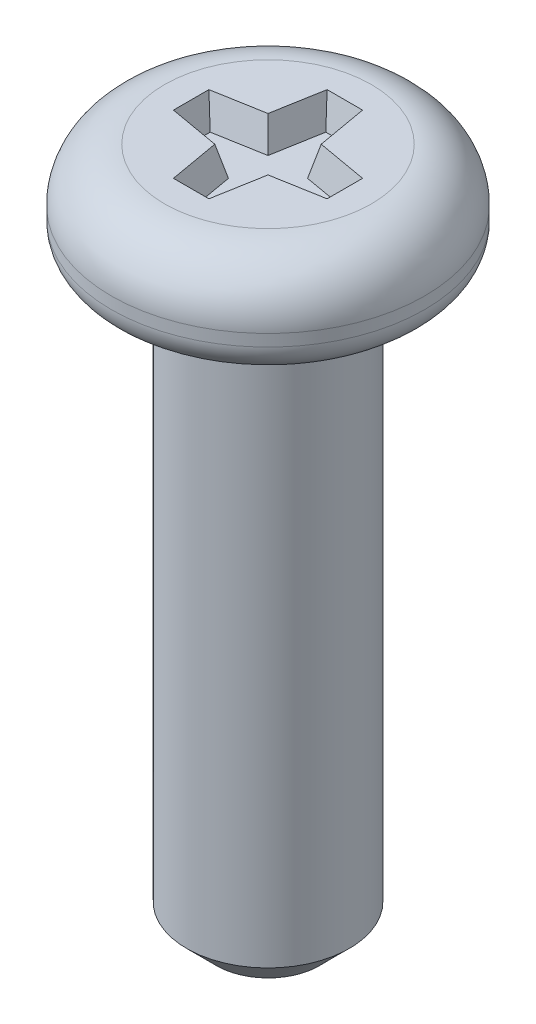
ISO-10303-21;
HEADER;
FILE_DESCRIPTION(('STEP AP214'),'2;1');
FILE_NAME('part.step','',(''),(''),'','','');
FILE_SCHEMA(('AUTOMOTIVE_DESIGN { 1 0 10303 214 1 1 1 1 }'));
ENDSEC;
DATA;
#1=APPLICATION_CONTEXT('core data for automotive mechanical design processes');
#2=APPLICATION_PROTOCOL_DEFINITION('international standard','automotive_design',2000,#1);
#3=PRODUCT_CONTEXT('',#1,'mechanical');
#4=PRODUCT('Part','Part','',(#3));
#5=PRODUCT_RELATED_PRODUCT_CATEGORY('part','',(#4));
#6=PRODUCT_DEFINITION_FORMATION('','',#4);
#7=PRODUCT_DEFINITION_CONTEXT('part definition',#1,'design');
#8=PRODUCT_DEFINITION('design','',#6,#7);
#9=PRODUCT_DEFINITION_SHAPE('','',#8);
#10=(LENGTH_UNIT() NAMED_UNIT(*) SI_UNIT(.MILLI.,.METRE.));
#11=(NAMED_UNIT(*) PLANE_ANGLE_UNIT() SI_UNIT($,.RADIAN.));
#12=(NAMED_UNIT(*) SI_UNIT($,.STERADIAN.) SOLID_ANGLE_UNIT());
#13=UNCERTAINTY_MEASURE_WITH_UNIT(LENGTH_MEASURE(1.E-05),#10,'distance_accuracy_value','');
#14=(GEOMETRIC_REPRESENTATION_CONTEXT(3) GLOBAL_UNCERTAINTY_ASSIGNED_CONTEXT((#13)) GLOBAL_UNIT_ASSIGNED_CONTEXT((#10,
#11,#12)) REPRESENTATION_CONTEXT('',''));
#15=CARTESIAN_POINT('',(0.,0.,0.));
#16=DIRECTION('',(0.,0.,1.));
#17=DIRECTION('',(1.,0.,0.));
#18=AXIS2_PLACEMENT_3D('',#15,#16,#17);
#19=CARTESIAN_POINT('',(1.75,0.,0.));
#20=DIRECTION('',(0.,-1.,0.));
#21=DIRECTION('',(1.,0.,0.));
#22=AXIS2_PLACEMENT_3D('',#19,#20,#21);
#23=PLANE('',#22);
#24=DIRECTION('',(-1.,0.,0.));
#25=VECTOR('',#24,1.);
#26=CARTESIAN_POINT('',(-0.300122066397808,0.,-1.3));
#27=LINE('',#26,#25);
#28=CARTESIAN_POINT('',(0.300122066397808,0.,-1.3));
#29=VERTEX_POINT('',#28);
#30=CARTESIAN_POINT('',(-0.300122066397808,0.,-1.3));
#31=VERTEX_POINT('',#30);
#32=EDGE_CURVE('E139',#29,#31,#27,.T.);
#33=ORIENTED_EDGE('',*,*,#32,.F.);
#34=DIRECTION('',(-0.173648177666927,0.,-0.984807753012208));
#35=VECTOR('',#34,1.);
#36=CARTESIAN_POINT('',(0.300122066397808,0.,-1.3));
#37=LINE('',#36,#35);
#38=CARTESIAN_POINT('',(0.45,0.,-0.45));
#39=VERTEX_POINT('',#38);
#40=EDGE_CURVE('E47',#39,#29,#37,.T.);
#41=ORIENTED_EDGE('',*,*,#40,.F.);
#42=DIRECTION('',(-0.984807753012208,0.,-0.173648177666927));
#43=VECTOR('',#42,1.);
#44=CARTESIAN_POINT('',(0.45,0.,-0.45));
#45=LINE('',#44,#43);
#46=CARTESIAN_POINT('',(1.3,0.,-0.300122066397808));
#47=VERTEX_POINT('',#46);
#48=EDGE_CURVE('E171',#47,#39,#45,.T.);
#49=ORIENTED_EDGE('',*,*,#48,.F.);
#50=DIRECTION('',(0.,0.,-1.));
#51=VECTOR('',#50,1.);
#52=CARTESIAN_POINT('',(1.3,0.,-0.300122066397808));
#53=LINE('',#52,#51);
#54=CARTESIAN_POINT('',(1.3,0.,0.300122066397808));
#55=VERTEX_POINT('',#54);
#56=EDGE_CURVE('E169',#55,#47,#53,.T.);
#57=ORIENTED_EDGE('',*,*,#56,.F.);
#58=DIRECTION('',(0.984807753012208,0.,-0.173648177666927));
#59=VECTOR('',#58,1.);
#60=CARTESIAN_POINT('',(0.45,0.,0.45));
#61=LINE('',#60,#59);
#62=CARTESIAN_POINT('',(0.45,0.,0.45));
#63=VERTEX_POINT('',#62);
#64=EDGE_CURVE('E166',#63,#55,#61,.T.);
#65=ORIENTED_EDGE('',*,*,#64,.F.);
#66=DIRECTION('',(0.173648177666927,0.,-0.984807753012208));
#67=VECTOR('',#66,1.);
#68=CARTESIAN_POINT('',(0.300122066397808,0.,1.3));
#69=LINE('',#68,#67);
#70=CARTESIAN_POINT('',(0.300122066397808,0.,1.3));
#71=VERTEX_POINT('',#70);
#72=EDGE_CURVE('E163',#71,#63,#69,.T.);
#73=ORIENTED_EDGE('',*,*,#72,.F.);
#74=DIRECTION('',(1.,0.,0.));
#75=VECTOR('',#74,1.);
#76=CARTESIAN_POINT('',(-0.300122066397808,0.,1.3));
#77=LINE('',#76,#75);
#78=CARTESIAN_POINT('',(-0.300122066397808,0.,1.3));
#79=VERTEX_POINT('',#78);
#80=EDGE_CURVE('E160',#79,#71,#77,.T.);
#81=ORIENTED_EDGE('',*,*,#80,.F.);
#82=DIRECTION('',(0.173648177666927,0.,0.984807753012208));
#83=VECTOR('',#82,1.);
#84=CARTESIAN_POINT('',(-0.300122066397808,0.,1.3));
#85=LINE('',#84,#83);
#86=CARTESIAN_POINT('',(-0.45,0.,0.45));
#87=VERTEX_POINT('',#86);
#88=EDGE_CURVE('E157',#87,#79,#85,.T.);
#89=ORIENTED_EDGE('',*,*,#88,.F.);
#90=DIRECTION('',(0.984807753012208,0.,0.173648177666927));
#91=VECTOR('',#90,1.);
#92=CARTESIAN_POINT('',(-0.45,0.,0.45));
#93=LINE('',#92,#91);
#94=CARTESIAN_POINT('',(-1.3,0.,0.300122066397808));
#95=VERTEX_POINT('',#94);
#96=EDGE_CURVE('E154',#95,#87,#93,.T.);
#97=ORIENTED_EDGE('',*,*,#96,.F.);
#98=DIRECTION('',(0.,0.,1.));
#99=VECTOR('',#98,1.);
#100=CARTESIAN_POINT('',(-1.3,0.,-0.300122066397808));
#101=LINE('',#100,#99);
#102=CARTESIAN_POINT('',(-1.3,0.,-0.300122066397808));
#103=VERTEX_POINT('',#102);
#104=EDGE_CURVE('E148',#103,#95,#101,.T.);
#105=ORIENTED_EDGE('',*,*,#104,.F.);
#106=DIRECTION('',(-0.984807753012208,0.,0.173648177666927));
#107=VECTOR('',#106,1.);
#108=CARTESIAN_POINT('',(-0.45,0.,-0.45));
#109=LINE('',#108,#107);
#110=CARTESIAN_POINT('',(-0.45,0.,-0.45));
#111=VERTEX_POINT('',#110);
#112=EDGE_CURVE('E146',#111,#103,#109,.T.);
#113=ORIENTED_EDGE('',*,*,#112,.F.);
#114=DIRECTION('',(-0.173648177666927,0.,0.984807753012208));
#115=VECTOR('',#114,1.);
#116=CARTESIAN_POINT('',(-0.300122066397808,0.,-1.3));
#117=LINE('',#116,#115);
#118=EDGE_CURVE('E130',#31,#111,#117,.T.);
#119=ORIENTED_EDGE('',*,*,#118,.F.);
#120=EDGE_LOOP('',(#33,#41,#49,#57,#65,#73,#81,#89,#97,#105,#113,#119));
#121=FACE_BOUND('',#120,.T.);
#122=CARTESIAN_POINT('',(0.,0.,0.));
#123=DIRECTION('',(0.,1.,0.));
#124=DIRECTION('',(-1.,0.,0.));
#125=AXIS2_PLACEMENT_3D('',#122,#123,#124);
#126=CIRCLE('',#125,1.75);
#127=CARTESIAN_POINT('',(-1.75,0.,0.));
#128=VERTEX_POINT('',#127);
#129=EDGE_CURVE('E11',#128,#128,#126,.T.);
#130=ORIENTED_EDGE('',*,*,#129,.T.);
#131=EDGE_LOOP('',(#130));
#132=FACE_BOUND('',#131,.T.);
#133=ADVANCED_FACE('F33',(#121,#132),#23,.F.);
#134=CARTESIAN_POINT('',(0.,-0.9,0.));
#135=DIRECTION('',(0.,1.,0.));
#136=DIRECTION('',(-1.,0.,0.));
#137=AXIS2_PLACEMENT_3D('',#134,#135,#136);
#138=TOROIDAL_SURFACE('',#137,1.75,0.9);
#139=ORIENTED_EDGE('',*,*,#129,.F.);
#140=EDGE_LOOP('',(#139));
#141=FACE_BOUND('',#140,.T.);
#142=CARTESIAN_POINT('',(0.,-0.9,0.));
#143=DIRECTION('',(0.,1.,0.));
#144=DIRECTION('',(-1.,0.,0.));
#145=AXIS2_PLACEMENT_3D('',#142,#143,#144);
#146=CIRCLE('',#145,2.65);
#147=CARTESIAN_POINT('',(-2.65,-0.900000000000001,0.));
#148=VERTEX_POINT('',#147);
#149=EDGE_CURVE('E40',#148,#148,#146,.T.);
#150=ORIENTED_EDGE('',*,*,#149,.T.);
#151=EDGE_LOOP('',(#150));
#152=FACE_BOUND('',#151,.T.);
#153=ADVANCED_FACE('F244',(#141,#152),#138,.T.);
#154=CARTESIAN_POINT('',(0.,0.,0.));
#155=DIRECTION('',(0.,1.,0.));
#156=DIRECTION('',(-1.,0.,0.));
#157=AXIS2_PLACEMENT_3D('',#154,#155,#156);
#158=CYLINDRICAL_SURFACE('',#157,2.65);
#159=ORIENTED_EDGE('',*,*,#149,.F.);
#160=EDGE_LOOP('',(#159));
#161=FACE_BOUND('',#160,.T.);
#162=CARTESIAN_POINT('',(0.,-1.1,0.));
#163=DIRECTION('',(0.,1.,0.));
#164=DIRECTION('',(-1.,0.,0.));
#165=AXIS2_PLACEMENT_3D('',#162,#163,#164);
#166=CIRCLE('',#165,2.65);
#167=CARTESIAN_POINT('',(-2.65,-1.1,0.));
#168=VERTEX_POINT('',#167);
#169=EDGE_CURVE('E239',#168,#168,#166,.T.);
#170=ORIENTED_EDGE('',*,*,#169,.T.);
#171=EDGE_LOOP('',(#170));
#172=FACE_BOUND('',#171,.T.);
#173=ADVANCED_FACE('F246',(#161,#172),#158,.T.);
#174=CARTESIAN_POINT('',(0.,-1.1,0.));
#175=DIRECTION('',(0.,1.,0.));
#176=DIRECTION('',(-1.,0.,0.));
#177=AXIS2_PLACEMENT_3D('',#174,#175,#176);
#178=TOROIDAL_SURFACE('',#177,2.15,0.5);
#179=ORIENTED_EDGE('',*,*,#169,.F.);
#180=EDGE_LOOP('',(#179));
#181=FACE_BOUND('',#180,.T.);
#182=CARTESIAN_POINT('',(0.,-1.6,0.));
#183=DIRECTION('',(0.,1.,0.));
#184=DIRECTION('',(-1.,0.,0.));
#185=AXIS2_PLACEMENT_3D('',#182,#183,#184);
#186=CIRCLE('',#185,2.15);
#187=CARTESIAN_POINT('',(-2.15,-1.6,0.));
#188=VERTEX_POINT('',#187);
#189=EDGE_CURVE('E236',#188,#188,#186,.T.);
#190=ORIENTED_EDGE('',*,*,#189,.T.);
#191=EDGE_LOOP('',(#190));
#192=FACE_BOUND('',#191,.T.);
#193=ADVANCED_FACE('F249',(#181,#192),#178,.T.);
#194=CARTESIAN_POINT('',(1.525,-1.6,0.));
#195=DIRECTION('',(0.,1.,0.));
#196=DIRECTION('',(-1.,0.,0.));
#197=AXIS2_PLACEMENT_3D('',#194,#195,#196);
#198=PLANE('',#197);
#199=ORIENTED_EDGE('',*,*,#189,.F.);
#200=EDGE_LOOP('',(#199));
#201=FACE_BOUND('',#200,.T.);
#202=CARTESIAN_POINT('',(0.,-1.6,0.));
#203=DIRECTION('',(0.,1.,0.));
#204=DIRECTION('',(-1.,0.,0.));
#205=AXIS2_PLACEMENT_3D('',#202,#203,#204);
#206=CIRCLE('',#205,1.525);
#207=CARTESIAN_POINT('',(-1.525,-1.6,0.));
#208=VERTEX_POINT('',#207);
#209=EDGE_CURVE('E233',#208,#208,#206,.T.);
#210=ORIENTED_EDGE('',*,*,#209,.T.);
#211=EDGE_LOOP('',(#210));
#212=FACE_BOUND('',#211,.T.);
#213=ADVANCED_FACE('F255',(#201,#212),#198,.F.);
#214=CARTESIAN_POINT('',(0.,-1.75,0.));
#215=DIRECTION('',(0.,1.,0.));
#216=DIRECTION('',(-1.,0.,0.));
#217=AXIS2_PLACEMENT_3D('',#214,#215,#216);
#218=TOROIDAL_SURFACE('',#217,1.525,0.15);
#219=ORIENTED_EDGE('',*,*,#209,.F.);
#220=EDGE_LOOP('',(#219));
#221=FACE_BOUND('',#220,.T.);
#222=CARTESIAN_POINT('',(0.,-1.75,0.));
#223=DIRECTION('',(0.,1.,0.));
#224=DIRECTION('',(-1.,0.,0.));
#225=AXIS2_PLACEMENT_3D('',#222,#223,#224);
#226=CIRCLE('',#225,1.375);
#227=CARTESIAN_POINT('',(-1.375,-1.75,0.));
#228=VERTEX_POINT('',#227);
#229=EDGE_CURVE('E230',#228,#228,#226,.T.);
#230=ORIENTED_EDGE('',*,*,#229,.T.);
#231=EDGE_LOOP('',(#230));
#232=FACE_BOUND('',#231,.T.);
#233=ADVANCED_FACE('F261',(#221,#232),#218,.F.);
#234=CARTESIAN_POINT('',(0.,0.,0.));
#235=DIRECTION('',(0.,1.,0.));
#236=DIRECTION('',(-1.,0.,0.));
#237=AXIS2_PLACEMENT_3D('',#234,#235,#236);
#238=CYLINDRICAL_SURFACE('',#237,1.375);
#239=ORIENTED_EDGE('',*,*,#229,.F.);
#240=EDGE_LOOP('',(#239));
#241=FACE_BOUND('',#240,.T.);
#242=CARTESIAN_POINT('',(0.,-11.1,0.));
#243=DIRECTION('',(0.,1.,0.));
#244=DIRECTION('',(-1.,0.,0.));
#245=AXIS2_PLACEMENT_3D('',#242,#243,#244);
#246=CIRCLE('',#245,1.375);
#247=CARTESIAN_POINT('',(-1.375,-11.1,0.));
#248=VERTEX_POINT('',#247);
#249=EDGE_CURVE('E227',#248,#248,#246,.T.);
#250=ORIENTED_EDGE('',*,*,#249,.T.);
#251=EDGE_LOOP('',(#250));
#252=FACE_BOUND('',#251,.T.);
#253=ADVANCED_FACE('F267',(#241,#252),#238,.T.);
#254=CARTESIAN_POINT('',(0.,-11.6,0.));
#255=DIRECTION('',(0.,1.,0.));
#256=DIRECTION('',(-1.,0.,0.));
#257=AXIS2_PLACEMENT_3D('',#254,#255,#256);
#258=CONICAL_SURFACE('',#257,0.875000000000006,0.78539816339744);
#259=ORIENTED_EDGE('',*,*,#249,.F.);
#260=EDGE_LOOP('',(#259));
#261=FACE_BOUND('',#260,.T.);
#262=CARTESIAN_POINT('',(0.,-11.6,0.));
#263=DIRECTION('',(0.,1.,0.));
#264=DIRECTION('',(-1.,0.,0.));
#265=AXIS2_PLACEMENT_3D('',#262,#263,#264);
#266=CIRCLE('',#265,0.875000000000006);
#267=CARTESIAN_POINT('',(-0.875000000000004,-11.6,0.));
#268=VERTEX_POINT('',#267);
#269=EDGE_CURVE('E175',#268,#268,#266,.T.);
#270=ORIENTED_EDGE('',*,*,#269,.T.);
#271=EDGE_LOOP('',(#270));
#272=FACE_BOUND('',#271,.T.);
#273=ADVANCED_FACE('F273',(#261,#272),#258,.T.);
#274=CARTESIAN_POINT('',(0.,-11.6,0.));
#275=DIRECTION('',(0.,1.,0.));
#276=DIRECTION('',(-1.,0.,0.));
#277=AXIS2_PLACEMENT_3D('',#274,#275,#276);
#278=PLANE('',#277);
#279=ORIENTED_EDGE('',*,*,#269,.F.);
#280=EDGE_LOOP('',(#279));
#281=FACE_BOUND('',#280,.T.);
#282=ADVANCED_FACE('F279',(#281),#278,.F.);
#283=CARTESIAN_POINT('',(0.300122066397808,0.,-1.3));
#284=DIRECTION('',(0.951251242564198,-0.258819045102521,-0.167731259496517));
#285=DIRECTION('',(0.262538491736643,0.964921520309631,0.));
#286=AXIS2_PLACEMENT_3D('',#283,#284,#285);
#287=PLANE('',#286);
#288=ORIENTED_EDGE('',*,*,#40,.T.);
#289=DIRECTION('',(0.212227769095221,0.943922256203466,-0.252923206267483));
#290=VECTOR('',#289,1.);
#291=CARTESIAN_POINT('',(0.300122066397808,0.,-1.3));
#292=LINE('',#291,#290);
#293=CARTESIAN_POINT('',(0.187704032126204,-0.5,-1.16602540378444));
#294=VERTEX_POINT('',#293);
#295=EDGE_CURVE('E90',#294,#29,#292,.T.);
#296=ORIENTED_EDGE('',*,*,#295,.F.);
#297=DIRECTION('',(-0.173648177666927,0.,-0.984807753012209));
#298=VECTOR('',#297,1.);
#299=CARTESIAN_POINT('',(0.381446150865339,-0.5,-0.0672592480849495));
#300=LINE('',#299,#298);
#301=CARTESIAN_POINT('',(0.33435071834194,-0.5,-0.33435071834194));
#302=VERTEX_POINT('',#301);
#303=EDGE_CURVE('E173',#302,#294,#300,.T.);
#304=ORIENTED_EDGE('',*,*,#303,.F.);
#305=DIRECTION('',(0.219836351209983,0.950444084296053,-0.219836351209983));
#306=VECTOR('',#305,1.);
#307=CARTESIAN_POINT('',(0.483835514146798,0.146285016481293,-0.483835514146798));
#308=LINE('',#307,#306);
#309=EDGE_CURVE('E55',#302,#39,#308,.T.);
#310=ORIENTED_EDGE('',*,*,#309,.T.);
#311=EDGE_LOOP('',(#288,#296,#304,#310));
#312=FACE_BOUND('',#311,.T.);
#313=ADVANCED_FACE('F284',(#312),#287,.F.);
#314=CARTESIAN_POINT('',(0.45,0.,-0.45));
#315=DIRECTION('',(0.167731259496517,-0.258819045102521,-0.951251242564198));
#316=DIRECTION('',(0.,0.964921520309631,-0.262538491736643));
#317=AXIS2_PLACEMENT_3D('',#314,#315,#316);
#318=PLANE('',#317);
#319=ORIENTED_EDGE('',*,*,#48,.T.);
#320=ORIENTED_EDGE('',*,*,#309,.F.);
#321=DIRECTION('',(-0.984807753012209,0.,-0.173648177666927));
#322=VECTOR('',#321,1.);
#323=CARTESIAN_POINT('',(0.0672592480849496,-0.5,-0.381446150865339));
#324=LINE('',#323,#322);
#325=CARTESIAN_POINT('',(1.16602540378444,-0.5,-0.187704032126204));
#326=VERTEX_POINT('',#325);
#327=EDGE_CURVE('E176',#326,#302,#324,.T.);
#328=ORIENTED_EDGE('',*,*,#327,.F.);
#329=DIRECTION('',(0.252923206267483,0.943922256203466,-0.212227769095221));
#330=VECTOR('',#329,1.);
#331=CARTESIAN_POINT('',(1.3,0.,-0.300122066397808));
#332=LINE('',#331,#330);
#333=EDGE_CURVE('E95',#326,#47,#332,.T.);
#334=ORIENTED_EDGE('',*,*,#333,.T.);
#335=EDGE_LOOP('',(#319,#320,#328,#334));
#336=FACE_BOUND('',#335,.T.);
#337=ADVANCED_FACE('F289',(#336),#318,.F.);
#338=CARTESIAN_POINT('',(1.3,0.,-0.300122066397808));
#339=DIRECTION('',(0.965925826289068,-0.258819045102521,0.));
#340=DIRECTION('',(0.258819045102521,0.965925826289068,0.));
#341=AXIS2_PLACEMENT_3D('',#338,#339,#340);
#342=PLANE('',#341);
#343=ORIENTED_EDGE('',*,*,#56,.T.);
#344=ORIENTED_EDGE('',*,*,#333,.F.);
#345=DIRECTION('',(0.,0.,-1.));
#346=VECTOR('',#345,1.);
#347=CARTESIAN_POINT('',(1.16602540378444,-0.5,0.));
#348=LINE('',#347,#346);
#349=CARTESIAN_POINT('',(1.16602540378444,-0.5,0.187704032126204));
#350=VERTEX_POINT('',#349);
#351=EDGE_CURVE('E199',#350,#326,#348,.T.);
#352=ORIENTED_EDGE('',*,*,#351,.F.);
#353=DIRECTION('',(0.252923206267483,0.943922256203466,0.212227769095221));
#354=VECTOR('',#353,1.);
#355=CARTESIAN_POINT('',(1.2536704209464,-0.172904342921303,0.261246933701336));
#356=LINE('',#355,#354);
#357=EDGE_CURVE('E191',#350,#55,#356,.T.);
#358=ORIENTED_EDGE('',*,*,#357,.T.);
#359=EDGE_LOOP('',(#343,#344,#352,#358));
#360=FACE_BOUND('',#359,.T.);
#361=ADVANCED_FACE('F347',(#360),#342,.F.);
#362=CARTESIAN_POINT('',(0.45,0.,0.45));
#363=DIRECTION('',(0.167731259496517,-0.258819045102521,0.951251242564198));
#364=DIRECTION('',(0.,-0.964921520309631,-0.262538491736643));
#365=AXIS2_PLACEMENT_3D('',#362,#363,#364);
#366=PLANE('',#365);
#367=ORIENTED_EDGE('',*,*,#64,.T.);
#368=ORIENTED_EDGE('',*,*,#357,.F.);
#369=DIRECTION('',(0.984807753012209,0.,-0.173648177666927));
#370=VECTOR('',#369,1.);
#371=CARTESIAN_POINT('',(0.0672592480849496,-0.5,0.381446150865339));
#372=LINE('',#371,#370);
#373=CARTESIAN_POINT('',(0.33435071834194,-0.5,0.33435071834194));
#374=VERTEX_POINT('',#373);
#375=EDGE_CURVE('E202',#374,#350,#372,.T.);
#376=ORIENTED_EDGE('',*,*,#375,.F.);
#377=DIRECTION('',(0.219836351209983,0.950444084296053,0.219836351209983));
#378=VECTOR('',#377,1.);
#379=CARTESIAN_POINT('',(0.45,0.,0.45));
#380=LINE('',#379,#378);
#381=EDGE_CURVE('E189',#374,#63,#380,.T.);
#382=ORIENTED_EDGE('',*,*,#381,.T.);
#383=EDGE_LOOP('',(#367,#368,#376,#382));
#384=FACE_BOUND('',#383,.T.);
#385=ADVANCED_FACE('F355',(#384),#366,.F.);
#386=CARTESIAN_POINT('',(0.300122066397808,0.,1.3));
#387=DIRECTION('',(0.951251242564198,-0.258819045102521,0.167731259496517));
#388=DIRECTION('',(0.262538491736643,0.964921520309631,0.));
#389=AXIS2_PLACEMENT_3D('',#386,#387,#388);
#390=PLANE('',#389);
#391=ORIENTED_EDGE('',*,*,#72,.T.);
#392=ORIENTED_EDGE('',*,*,#381,.F.);
#393=DIRECTION('',(0.173648177666927,0.,-0.984807753012209));
#394=VECTOR('',#393,1.);
#395=CARTESIAN_POINT('',(0.381446150865339,-0.5,0.0672592480849495));
#396=LINE('',#395,#394);
#397=CARTESIAN_POINT('',(0.187704032126204,-0.5,1.16602540378444));
#398=VERTEX_POINT('',#397);
#399=EDGE_CURVE('E205',#398,#374,#396,.T.);
#400=ORIENTED_EDGE('',*,*,#399,.F.);
#401=DIRECTION('',(0.212227769095221,0.943922256203466,0.252923206267483));
#402=VECTOR('',#401,1.);
#403=CARTESIAN_POINT('',(0.273086694918792,-0.120244815052087,1.26778049891276));
#404=LINE('',#403,#402);
#405=EDGE_CURVE('E187',#398,#71,#404,.T.);
#406=ORIENTED_EDGE('',*,*,#405,.T.);
#407=EDGE_LOOP('',(#391,#392,#400,#406));
#408=FACE_BOUND('',#407,.T.);
#409=ADVANCED_FACE('F365',(#408),#390,.F.);
#410=CARTESIAN_POINT('',(-0.300122066397808,0.,1.3));
#411=DIRECTION('',(0.,-0.258819045102521,0.965925826289068));
#412=DIRECTION('',(0.,-0.965925826289068,-0.258819045102521));
#413=AXIS2_PLACEMENT_3D('',#410,#411,#412);
#414=PLANE('',#413);
#415=ORIENTED_EDGE('',*,*,#80,.T.);
#416=ORIENTED_EDGE('',*,*,#405,.F.);
#417=DIRECTION('',(1.,0.,0.));
#418=VECTOR('',#417,1.);
#419=CARTESIAN_POINT('',(0.,-0.5,1.16602540378444));
#420=LINE('',#419,#418);
#421=CARTESIAN_POINT('',(-0.187704032126204,-0.5,1.16602540378444));
#422=VERTEX_POINT('',#421);
#423=EDGE_CURVE('E208',#422,#398,#420,.T.);
#424=ORIENTED_EDGE('',*,*,#423,.F.);
#425=DIRECTION('',(-0.212227769095221,0.943922256203466,0.252923206267483));
#426=VECTOR('',#425,1.);
#427=CARTESIAN_POINT('',(-0.300122066397808,0.,1.3));
#428=LINE('',#427,#426);
#429=EDGE_CURVE('E185',#422,#79,#428,.T.);
#430=ORIENTED_EDGE('',*,*,#429,.T.);
#431=EDGE_LOOP('',(#415,#416,#424,#430));
#432=FACE_BOUND('',#431,.T.);
#433=ADVANCED_FACE('F375',(#432),#414,.F.);
#434=CARTESIAN_POINT('',(-0.300122066397808,0.,1.3));
#435=DIRECTION('',(-0.951251242564198,-0.258819045102521,0.167731259496517));
#436=DIRECTION('',(0.262538491736643,-0.964921520309631,0.));
#437=AXIS2_PLACEMENT_3D('',#434,#435,#436);
#438=PLANE('',#437);
#439=ORIENTED_EDGE('',*,*,#88,.T.);
#440=ORIENTED_EDGE('',*,*,#429,.F.);
#441=DIRECTION('',(0.173648177666927,0.,0.984807753012209));
#442=VECTOR('',#441,1.);
#443=CARTESIAN_POINT('',(-0.381446150865339,-0.5,0.0672592480849495));
#444=LINE('',#443,#442);
#445=CARTESIAN_POINT('',(-0.33435071834194,-0.5,0.33435071834194));
#446=VERTEX_POINT('',#445);
#447=EDGE_CURVE('E211',#446,#422,#444,.T.);
#448=ORIENTED_EDGE('',*,*,#447,.F.);
#449=DIRECTION('',(-0.219836351209983,0.950444084296053,0.219836351209983));
#450=VECTOR('',#449,1.);
#451=CARTESIAN_POINT('',(-0.483835514146798,0.146285016481293,0.483835514146798));
#452=LINE('',#451,#450);
#453=EDGE_CURVE('E183',#446,#87,#452,.T.);
#454=ORIENTED_EDGE('',*,*,#453,.T.);
#455=EDGE_LOOP('',(#439,#440,#448,#454));
#456=FACE_BOUND('',#455,.T.);
#457=ADVANCED_FACE('F385',(#456),#438,.F.);
#458=CARTESIAN_POINT('',(-0.45,0.,0.45));
#459=DIRECTION('',(-0.167731259496517,-0.258819045102521,0.951251242564198));
#460=DIRECTION('',(0.,-0.964921520309631,-0.262538491736643));
#461=AXIS2_PLACEMENT_3D('',#458,#459,#460);
#462=PLANE('',#461);
#463=ORIENTED_EDGE('',*,*,#96,.T.);
#464=ORIENTED_EDGE('',*,*,#453,.F.);
#465=DIRECTION('',(0.984807753012209,0.,0.173648177666927));
#466=VECTOR('',#465,1.);
#467=CARTESIAN_POINT('',(-0.0672592480849494,-0.5,0.381446150865339));
#468=LINE('',#467,#466);
#469=CARTESIAN_POINT('',(-1.16602540378444,-0.5,0.187704032126204));
#470=VERTEX_POINT('',#469);
#471=EDGE_CURVE('E214',#470,#446,#468,.T.);
#472=ORIENTED_EDGE('',*,*,#471,.F.);
#473=DIRECTION('',(-0.252923206267483,0.943922256203466,0.212227769095221));
#474=VECTOR('',#473,1.);
#475=CARTESIAN_POINT('',(-1.26778049891276,-0.120244815052087,0.273086694918791));
#476=LINE('',#475,#474);
#477=EDGE_CURVE('E181',#470,#95,#476,.T.);
#478=ORIENTED_EDGE('',*,*,#477,.T.);
#479=EDGE_LOOP('',(#463,#464,#472,#478));
#480=FACE_BOUND('',#479,.T.);
#481=ADVANCED_FACE('F395',(#480),#462,.F.);
#482=CARTESIAN_POINT('',(-1.3,0.,-0.300122066397808));
#483=DIRECTION('',(-0.965925826289068,-0.258819045102521,0.));
#484=DIRECTION('',(0.258819045102521,-0.965925826289068,0.));
#485=AXIS2_PLACEMENT_3D('',#482,#483,#484);
#486=PLANE('',#485);
#487=ORIENTED_EDGE('',*,*,#104,.T.);
#488=ORIENTED_EDGE('',*,*,#477,.F.);
#489=DIRECTION('',(0.,0.,1.));
#490=VECTOR('',#489,1.);
#491=CARTESIAN_POINT('',(-1.16602540378444,-0.5,0.));
#492=LINE('',#491,#490);
#493=CARTESIAN_POINT('',(-1.16602540378444,-0.5,-0.187704032126204));
#494=VERTEX_POINT('',#493);
#495=EDGE_CURVE('E217',#494,#470,#492,.T.);
#496=ORIENTED_EDGE('',*,*,#495,.F.);
#497=DIRECTION('',(-0.252923206267483,0.943922256203466,-0.212227769095221));
#498=VECTOR('',#497,1.);
#499=CARTESIAN_POINT('',(-1.2536704209464,-0.172904342921303,-0.261246933701336));
#500=LINE('',#499,#498);
#501=EDGE_CURVE('E179',#494,#103,#500,.T.);
#502=ORIENTED_EDGE('',*,*,#501,.T.);
#503=EDGE_LOOP('',(#487,#488,#496,#502));
#504=FACE_BOUND('',#503,.T.);
#505=ADVANCED_FACE('F405',(#504),#486,.F.);
#506=CARTESIAN_POINT('',(-0.45,0.,-0.45));
#507=DIRECTION('',(-0.167731259496517,-0.258819045102521,-0.951251242564198));
#508=DIRECTION('',(0.,0.964921520309631,-0.262538491736643));
#509=AXIS2_PLACEMENT_3D('',#506,#507,#508);
#510=PLANE('',#509);
#511=ORIENTED_EDGE('',*,*,#112,.T.);
#512=ORIENTED_EDGE('',*,*,#501,.F.);
#513=DIRECTION('',(-0.984807753012209,0.,0.173648177666927));
#514=VECTOR('',#513,1.);
#515=CARTESIAN_POINT('',(-0.0672592480849494,-0.5,-0.381446150865339));
#516=LINE('',#515,#514);
#517=CARTESIAN_POINT('',(-0.33435071834194,-0.5,-0.33435071834194));
#518=VERTEX_POINT('',#517);
#519=EDGE_CURVE('E220',#518,#494,#516,.T.);
#520=ORIENTED_EDGE('',*,*,#519,.F.);
#521=DIRECTION('',(-0.219836351209983,0.950444084296053,-0.219836351209983));
#522=VECTOR('',#521,1.);
#523=CARTESIAN_POINT('',(-0.45,0.,-0.45));
#524=LINE('',#523,#522);
#525=EDGE_CURVE('E136',#518,#111,#524,.T.);
#526=ORIENTED_EDGE('',*,*,#525,.T.);
#527=EDGE_LOOP('',(#511,#512,#520,#526));
#528=FACE_BOUND('',#527,.T.);
#529=ADVANCED_FACE('F415',(#528),#510,.F.);
#530=CARTESIAN_POINT('',(-0.300122066397808,0.,-1.3));
#531=DIRECTION('',(-0.951251242564198,-0.258819045102521,-0.167731259496517));
#532=DIRECTION('',(0.262538491736643,-0.964921520309631,0.));
#533=AXIS2_PLACEMENT_3D('',#530,#531,#532);
#534=PLANE('',#533);
#535=ORIENTED_EDGE('',*,*,#118,.T.);
#536=ORIENTED_EDGE('',*,*,#525,.F.);
#537=DIRECTION('',(-0.173648177666927,0.,0.984807753012209));
#538=VECTOR('',#537,1.);
#539=CARTESIAN_POINT('',(-0.381446150865339,-0.5,-0.0672592480849495));
#540=LINE('',#539,#538);
#541=CARTESIAN_POINT('',(-0.187704032126204,-0.5,-1.16602540378444));
#542=VERTEX_POINT('',#541);
#543=EDGE_CURVE('E133',#542,#518,#540,.T.);
#544=ORIENTED_EDGE('',*,*,#543,.F.);
#545=DIRECTION('',(-0.212227769095221,0.943922256203466,-0.252923206267483));
#546=VECTOR('',#545,1.);
#547=CARTESIAN_POINT('',(-0.300122066397808,0.,-1.3));
#548=LINE('',#547,#546);
#549=EDGE_CURVE('E126',#542,#31,#548,.T.);
#550=ORIENTED_EDGE('',*,*,#549,.T.);
#551=EDGE_LOOP('',(#535,#536,#544,#550));
#552=FACE_BOUND('',#551,.T.);
#553=ADVANCED_FACE('F128',(#552),#534,.F.);
#554=CARTESIAN_POINT('',(-0.300122066397808,0.,-1.3));
#555=DIRECTION('',(0.,-0.258819045102521,-0.965925826289068));
#556=DIRECTION('',(0.,0.965925826289068,-0.258819045102521));
#557=AXIS2_PLACEMENT_3D('',#554,#555,#556);
#558=PLANE('',#557);
#559=ORIENTED_EDGE('',*,*,#32,.T.);
#560=ORIENTED_EDGE('',*,*,#549,.F.);
#561=DIRECTION('',(-1.,0.,0.));
#562=VECTOR('',#561,1.);
#563=CARTESIAN_POINT('',(0.,-0.5,-1.16602540378444));
#564=LINE('',#563,#562);
#565=EDGE_CURVE('E196',#294,#542,#564,.T.);
#566=ORIENTED_EDGE('',*,*,#565,.F.);
#567=ORIENTED_EDGE('',*,*,#295,.T.);
#568=EDGE_LOOP('',(#559,#560,#566,#567));
#569=FACE_BOUND('',#568,.T.);
#570=ADVANCED_FACE('F140',(#569),#558,.F.);
#571=CARTESIAN_POINT('',(0.,-0.5,0.));
#572=DIRECTION('',(0.,1.,0.));
#573=DIRECTION('',(-1.,0.,0.));
#574=AXIS2_PLACEMENT_3D('',#571,#572,#573);
#575=PLANE('',#574);
#576=ORIENTED_EDGE('',*,*,#303,.T.);
#577=ORIENTED_EDGE('',*,*,#565,.T.);
#578=ORIENTED_EDGE('',*,*,#543,.T.);
#579=ORIENTED_EDGE('',*,*,#519,.T.);
#580=ORIENTED_EDGE('',*,*,#495,.T.);
#581=ORIENTED_EDGE('',*,*,#471,.T.);
#582=ORIENTED_EDGE('',*,*,#447,.T.);
#583=ORIENTED_EDGE('',*,*,#423,.T.);
#584=ORIENTED_EDGE('',*,*,#399,.T.);
#585=ORIENTED_EDGE('',*,*,#375,.T.);
#586=ORIENTED_EDGE('',*,*,#351,.T.);
#587=ORIENTED_EDGE('',*,*,#327,.T.);
#588=EDGE_LOOP('',(#576,#577,#578,#579,#580,#581,#582,#583,#584,#585,#586,#587));
#589=FACE_BOUND('',#588,.T.);
#590=ADVANCED_FACE('F442',(#589),#575,.T.);
#591=CLOSED_SHELL('',(#133,#153,#173,#193,#213,#233,#253,#273,#282,#313,#337,#361,#385,#409,
#433,#457,#481,#505,#529,#553,#570,#590));
#592=MANIFOLD_SOLID_BREP('B2',#591);
#593=ADVANCED_BREP_SHAPE_REPRESENTATION('',(#18,#592),#14);
#594=SHAPE_DEFINITION_REPRESENTATION(#9,#593);
ENDSEC;
END-ISO-10303-21;
